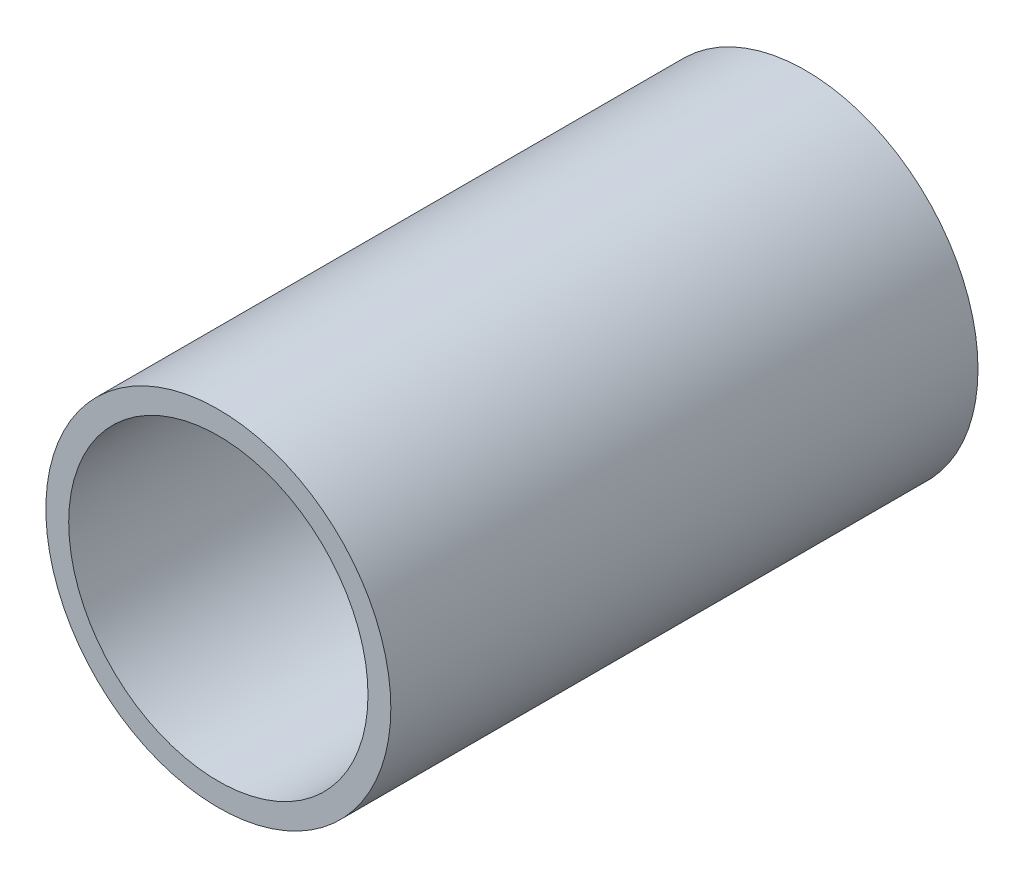
ISO-10303-21;
HEADER;
FILE_DESCRIPTION(('STEP AP214'),'2;1');
FILE_NAME('part.step','',(''),(''),'','','');
FILE_SCHEMA(('AUTOMOTIVE_DESIGN { 1 0 10303 214 1 1 1 1 }'));
ENDSEC;
DATA;
#1=APPLICATION_CONTEXT('core data for automotive mechanical design processes');
#2=APPLICATION_PROTOCOL_DEFINITION('international standard','automotive_design',2000,#1);
#3=PRODUCT_CONTEXT('',#1,'mechanical');
#4=PRODUCT('Part','Part','',(#3));
#5=PRODUCT_RELATED_PRODUCT_CATEGORY('part','',(#4));
#6=PRODUCT_DEFINITION_FORMATION('','',#4);
#7=PRODUCT_DEFINITION_CONTEXT('part definition',#1,'design');
#8=PRODUCT_DEFINITION('design','',#6,#7);
#9=PRODUCT_DEFINITION_SHAPE('','',#8);
#10=(LENGTH_UNIT() NAMED_UNIT(*) SI_UNIT(.MILLI.,.METRE.));
#11=(NAMED_UNIT(*) PLANE_ANGLE_UNIT() SI_UNIT($,.RADIAN.));
#12=(NAMED_UNIT(*) SI_UNIT($,.STERADIAN.) SOLID_ANGLE_UNIT());
#13=UNCERTAINTY_MEASURE_WITH_UNIT(LENGTH_MEASURE(1.E-05),#10,'distance_accuracy_value','');
#14=(GEOMETRIC_REPRESENTATION_CONTEXT(3) GLOBAL_UNCERTAINTY_ASSIGNED_CONTEXT((#13)) GLOBAL_UNIT_ASSIGNED_CONTEXT((#10,
#11,#12)) REPRESENTATION_CONTEXT('',''));
#15=CARTESIAN_POINT('',(0.,0.,0.));
#16=DIRECTION('',(0.,0.,1.));
#17=DIRECTION('',(1.,0.,0.));
#18=AXIS2_PLACEMENT_3D('',#15,#16,#17);
#19=CARTESIAN_POINT('',(0.,0.,25.7));
#20=DIRECTION('',(0.,0.,1.));
#21=DIRECTION('',(1.,0.,0.));
#22=AXIS2_PLACEMENT_3D('',#19,#20,#21);
#23=PLANE('',#22);
#24=CARTESIAN_POINT('',(0.,0.,25.7));
#25=DIRECTION('',(0.,0.,1.));
#26=DIRECTION('',(1.,0.,0.));
#27=AXIS2_PLACEMENT_3D('',#24,#25,#26);
#28=CIRCLE('',#27,7.55);
#29=CARTESIAN_POINT('',(7.55,0.,25.7));
#30=VERTEX_POINT('',#29);
#31=EDGE_CURVE('E10',#30,#30,#28,.T.);
#32=ORIENTED_EDGE('',*,*,#31,.T.);
#33=EDGE_LOOP('',(#32));
#34=FACE_BOUND('',#33,.T.);
#35=CARTESIAN_POINT('',(0.,0.,25.7));
#36=DIRECTION('',(0.,0.,1.));
#37=DIRECTION('',(1.,0.,0.));
#38=AXIS2_PLACEMENT_3D('',#35,#36,#37);
#39=CIRCLE('',#38,6.55);
#40=CARTESIAN_POINT('',(6.55,0.,25.7));
#41=VERTEX_POINT('',#40);
#42=EDGE_CURVE('E42',#41,#41,#39,.T.);
#43=ORIENTED_EDGE('',*,*,#42,.F.);
#44=EDGE_LOOP('',(#43));
#45=FACE_BOUND('',#44,.T.);
#46=ADVANCED_FACE('F31',(#34,#45),#23,.T.);
#47=CARTESIAN_POINT('',(0.,0.,0.));
#48=DIRECTION('',(0.,0.,1.));
#49=DIRECTION('',(1.,0.,0.));
#50=AXIS2_PLACEMENT_3D('',#47,#48,#49);
#51=PLANE('',#50);
#52=CARTESIAN_POINT('',(0.,0.,0.));
#53=DIRECTION('',(0.,0.,1.));
#54=DIRECTION('',(1.,0.,0.));
#55=AXIS2_PLACEMENT_3D('',#52,#53,#54);
#56=CIRCLE('',#55,7.55);
#57=CARTESIAN_POINT('',(7.55,0.,0.));
#58=VERTEX_POINT('',#57);
#59=EDGE_CURVE('E35',#58,#58,#56,.T.);
#60=ORIENTED_EDGE('',*,*,#59,.F.);
#61=EDGE_LOOP('',(#60));
#62=FACE_BOUND('',#61,.T.);
#63=CARTESIAN_POINT('',(0.,0.,0.));
#64=DIRECTION('',(0.,0.,1.));
#65=DIRECTION('',(1.,0.,0.));
#66=AXIS2_PLACEMENT_3D('',#63,#64,#65);
#67=CIRCLE('',#66,6.55);
#68=CARTESIAN_POINT('',(6.55,0.,0.));
#69=VERTEX_POINT('',#68);
#70=EDGE_CURVE('E44',#69,#69,#67,.T.);
#71=ORIENTED_EDGE('',*,*,#70,.T.);
#72=EDGE_LOOP('',(#71));
#73=FACE_BOUND('',#72,.T.);
#74=ADVANCED_FACE('F54',(#62,#73),#51,.F.);
#75=CARTESIAN_POINT('',(0.,0.,25.7));
#76=DIRECTION('',(0.,0.,-1.));
#77=DIRECTION('',(-1.,0.,0.));
#78=AXIS2_PLACEMENT_3D('',#75,#76,#77);
#79=CYLINDRICAL_SURFACE('',#78,7.55);
#80=ORIENTED_EDGE('',*,*,#31,.F.);
#81=EDGE_LOOP('',(#80));
#82=FACE_BOUND('',#81,.T.);
#83=ORIENTED_EDGE('',*,*,#59,.T.);
#84=EDGE_LOOP('',(#83));
#85=FACE_BOUND('',#84,.T.);
#86=ADVANCED_FACE('F33',(#82,#85),#79,.T.);
#87=CARTESIAN_POINT('',(0.,0.,25.7));
#88=DIRECTION('',(0.,0.,-1.));
#89=DIRECTION('',(-1.,0.,0.));
#90=AXIS2_PLACEMENT_3D('',#87,#88,#89);
#91=CYLINDRICAL_SURFACE('',#90,6.55);
#92=ORIENTED_EDGE('',*,*,#42,.T.);
#93=EDGE_LOOP('',(#92));
#94=FACE_BOUND('',#93,.T.);
#95=ORIENTED_EDGE('',*,*,#70,.F.);
#96=EDGE_LOOP('',(#95));
#97=FACE_BOUND('',#96,.T.);
#98=ADVANCED_FACE('F50',(#94,#97),#91,.F.);
#99=CLOSED_SHELL('',(#46,#74,#86,#98));
#100=MANIFOLD_SOLID_BREP('B2',#99);
#101=ADVANCED_BREP_SHAPE_REPRESENTATION('',(#18,#100),#14);
#102=SHAPE_DEFINITION_REPRESENTATION(#9,#101);
ENDSEC;
END-ISO-10303-21;
